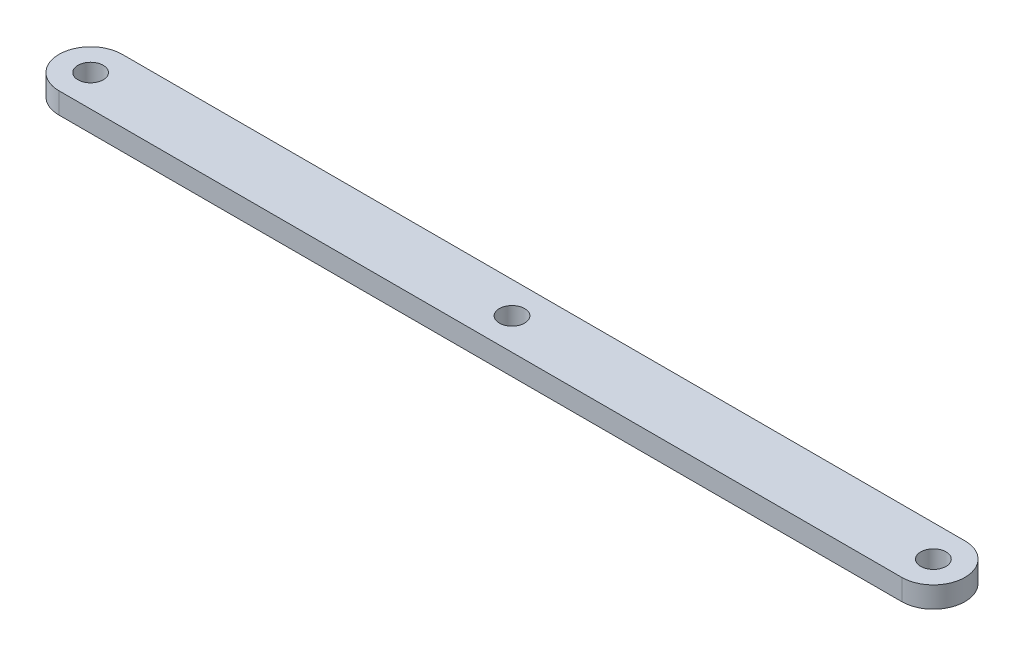
ISO-10303-21;
HEADER;
FILE_DESCRIPTION(('STEP AP214'),'2;1');
FILE_NAME('part.step','',(''),(''),'','','');
FILE_SCHEMA(('AUTOMOTIVE_DESIGN { 1 0 10303 214 1 1 1 1 }'));
ENDSEC;
DATA;
#1=APPLICATION_CONTEXT('core data for automotive mechanical design processes');
#2=APPLICATION_PROTOCOL_DEFINITION('international standard','automotive_design',2000,#1);
#3=PRODUCT_CONTEXT('',#1,'mechanical');
#4=PRODUCT('Part','Part','',(#3));
#5=PRODUCT_RELATED_PRODUCT_CATEGORY('part','',(#4));
#6=PRODUCT_DEFINITION_FORMATION('','',#4);
#7=PRODUCT_DEFINITION_CONTEXT('part definition',#1,'design');
#8=PRODUCT_DEFINITION('design','',#6,#7);
#9=PRODUCT_DEFINITION_SHAPE('','',#8);
#10=(LENGTH_UNIT() NAMED_UNIT(*) SI_UNIT(.MILLI.,.METRE.));
#11=(NAMED_UNIT(*) PLANE_ANGLE_UNIT() SI_UNIT($,.RADIAN.));
#12=(NAMED_UNIT(*) SI_UNIT($,.STERADIAN.) SOLID_ANGLE_UNIT());
#13=UNCERTAINTY_MEASURE_WITH_UNIT(LENGTH_MEASURE(1.E-05),#10,'distance_accuracy_value','');
#14=(GEOMETRIC_REPRESENTATION_CONTEXT(3) GLOBAL_UNCERTAINTY_ASSIGNED_CONTEXT((#13)) GLOBAL_UNIT_ASSIGNED_CONTEXT((#10,
#11,#12)) REPRESENTATION_CONTEXT('',''));
#15=CARTESIAN_POINT('',(0.,0.,0.));
#16=DIRECTION('',(0.,0.,1.));
#17=DIRECTION('',(1.,0.,0.));
#18=AXIS2_PLACEMENT_3D('',#15,#16,#17);
#19=CARTESIAN_POINT('',(0.,5.,0.));
#20=DIRECTION('',(0.,1.,0.));
#21=DIRECTION('',(0.,0.,1.));
#22=AXIS2_PLACEMENT_3D('',#19,#20,#21);
#23=PLANE('',#22);
#24=CARTESIAN_POINT('',(200.,5.,0.));
#25=DIRECTION('',(0.,1.,0.));
#26=DIRECTION('',(0.,0.,1.));
#27=AXIS2_PLACEMENT_3D('',#24,#25,#26);
#28=CIRCLE('',#27,2.99999999999999);
#29=CARTESIAN_POINT('',(200.,5.,2.99999999999999));
#30=VERTEX_POINT('',#29);
#31=EDGE_CURVE('E121',#30,#30,#28,.T.);
#32=ORIENTED_EDGE('',*,*,#31,.F.);
#33=EDGE_LOOP('',(#32));
#34=FACE_BOUND('',#33,.T.);
#35=CARTESIAN_POINT('',(0.,5.,0.));
#36=DIRECTION('',(0.,1.,0.));
#37=DIRECTION('',(0.,0.,1.));
#38=AXIS2_PLACEMENT_3D('',#35,#36,#37);
#39=CIRCLE('',#38,7.5);
#40=CARTESIAN_POINT('',(0.,5.,-7.5));
#41=VERTEX_POINT('',#40);
#42=CARTESIAN_POINT('',(0.,5.,7.5));
#43=VERTEX_POINT('',#42);
#44=EDGE_CURVE('E91',#41,#43,#39,.T.);
#45=ORIENTED_EDGE('',*,*,#44,.T.);
#46=DIRECTION('',(1.,0.,0.));
#47=VECTOR('',#46,1.);
#48=CARTESIAN_POINT('',(0.,5.,7.5));
#49=LINE('',#48,#47);
#50=CARTESIAN_POINT('',(200.,5.,7.50000000000001));
#51=VERTEX_POINT('',#50);
#52=EDGE_CURVE('E86',#43,#51,#49,.T.);
#53=ORIENTED_EDGE('',*,*,#52,.T.);
#54=CARTESIAN_POINT('',(200.,5.,0.));
#55=DIRECTION('',(0.,1.,0.));
#56=DIRECTION('',(0.,0.,1.));
#57=AXIS2_PLACEMENT_3D('',#54,#55,#56);
#58=CIRCLE('',#57,7.50000000000001);
#59=CARTESIAN_POINT('',(200.,5.,-7.50000000000001));
#60=VERTEX_POINT('',#59);
#61=EDGE_CURVE('E89',#51,#60,#58,.T.);
#62=ORIENTED_EDGE('',*,*,#61,.T.);
#63=DIRECTION('',(-1.,0.,0.));
#64=VECTOR('',#63,1.);
#65=CARTESIAN_POINT('',(0.,5.,-7.5));
#66=LINE('',#65,#64);
#67=EDGE_CURVE('E56',#60,#41,#66,.T.);
#68=ORIENTED_EDGE('',*,*,#67,.T.);
#69=EDGE_LOOP('',(#45,#53,#62,#68));
#70=FACE_BOUND('',#69,.T.);
#71=CARTESIAN_POINT('',(100.,5.,0.));
#72=DIRECTION('',(0.,1.,0.));
#73=DIRECTION('',(0.,0.,1.));
#74=AXIS2_PLACEMENT_3D('',#71,#72,#73);
#75=CIRCLE('',#74,3.00000000000001);
#76=CARTESIAN_POINT('',(100.,5.,3.00000000000001));
#77=VERTEX_POINT('',#76);
#78=EDGE_CURVE('E106',#77,#77,#75,.T.);
#79=ORIENTED_EDGE('',*,*,#78,.F.);
#80=EDGE_LOOP('',(#79));
#81=FACE_BOUND('',#80,.T.);
#82=CARTESIAN_POINT('',(0.,5.,0.));
#83=DIRECTION('',(0.,1.,0.));
#84=DIRECTION('',(0.,0.,1.));
#85=AXIS2_PLACEMENT_3D('',#82,#83,#84);
#86=CIRCLE('',#85,3.);
#87=CARTESIAN_POINT('',(0.,5.,3.));
#88=VERTEX_POINT('',#87);
#89=EDGE_CURVE('E127',#88,#88,#86,.T.);
#90=ORIENTED_EDGE('',*,*,#89,.F.);
#91=EDGE_LOOP('',(#90));
#92=FACE_BOUND('',#91,.T.);
#93=ADVANCED_FACE('F39',(#34,#70,#81,#92),#23,.T.);
#94=CARTESIAN_POINT('',(0.,0.,0.));
#95=DIRECTION('',(0.,1.,0.));
#96=DIRECTION('',(0.,0.,1.));
#97=AXIS2_PLACEMENT_3D('',#94,#95,#96);
#98=PLANE('',#97);
#99=CARTESIAN_POINT('',(0.,0.,0.));
#100=DIRECTION('',(0.,1.,0.));
#101=DIRECTION('',(0.,0.,1.));
#102=AXIS2_PLACEMENT_3D('',#99,#100,#101);
#103=CIRCLE('',#102,7.5);
#104=CARTESIAN_POINT('',(0.,0.,-7.5));
#105=VERTEX_POINT('',#104);
#106=CARTESIAN_POINT('',(0.,0.,7.5));
#107=VERTEX_POINT('',#106);
#108=EDGE_CURVE('E103',#105,#107,#103,.T.);
#109=ORIENTED_EDGE('',*,*,#108,.F.);
#110=DIRECTION('',(-1.,0.,0.));
#111=VECTOR('',#110,1.);
#112=CARTESIAN_POINT('',(0.,0.,-7.5));
#113=LINE('',#112,#111);
#114=CARTESIAN_POINT('',(200.,0.,-7.50000000000001));
#115=VERTEX_POINT('',#114);
#116=EDGE_CURVE('E79',#115,#105,#113,.T.);
#117=ORIENTED_EDGE('',*,*,#116,.F.);
#118=CARTESIAN_POINT('',(200.,0.,0.));
#119=DIRECTION('',(0.,1.,0.));
#120=DIRECTION('',(0.,0.,1.));
#121=AXIS2_PLACEMENT_3D('',#118,#119,#120);
#122=CIRCLE('',#121,7.50000000000001);
#123=CARTESIAN_POINT('',(200.,0.,7.50000000000001));
#124=VERTEX_POINT('',#123);
#125=EDGE_CURVE('E73',#124,#115,#122,.T.);
#126=ORIENTED_EDGE('',*,*,#125,.F.);
#127=DIRECTION('',(1.,0.,0.));
#128=VECTOR('',#127,1.);
#129=CARTESIAN_POINT('',(0.,0.,7.5));
#130=LINE('',#129,#128);
#131=EDGE_CURVE('E95',#107,#124,#130,.T.);
#132=ORIENTED_EDGE('',*,*,#131,.F.);
#133=EDGE_LOOP('',(#109,#117,#126,#132));
#134=FACE_BOUND('',#133,.T.);
#135=CARTESIAN_POINT('',(100.,0.,0.));
#136=DIRECTION('',(0.,1.,0.));
#137=DIRECTION('',(0.,0.,1.));
#138=AXIS2_PLACEMENT_3D('',#135,#136,#137);
#139=CIRCLE('',#138,3.00000000000001);
#140=CARTESIAN_POINT('',(100.,0.,3.00000000000001));
#141=VERTEX_POINT('',#140);
#142=EDGE_CURVE('E118',#141,#141,#139,.T.);
#143=ORIENTED_EDGE('',*,*,#142,.T.);
#144=EDGE_LOOP('',(#143));
#145=FACE_BOUND('',#144,.T.);
#146=CARTESIAN_POINT('',(200.,0.,0.));
#147=DIRECTION('',(0.,1.,0.));
#148=DIRECTION('',(0.,0.,1.));
#149=AXIS2_PLACEMENT_3D('',#146,#147,#148);
#150=CIRCLE('',#149,2.99999999999999);
#151=CARTESIAN_POINT('',(200.,0.,2.99999999999999));
#152=VERTEX_POINT('',#151);
#153=EDGE_CURVE('E124',#152,#152,#150,.T.);
#154=ORIENTED_EDGE('',*,*,#153,.T.);
#155=EDGE_LOOP('',(#154));
#156=FACE_BOUND('',#155,.T.);
#157=CARTESIAN_POINT('',(0.,0.,0.));
#158=DIRECTION('',(0.,1.,0.));
#159=DIRECTION('',(0.,0.,1.));
#160=AXIS2_PLACEMENT_3D('',#157,#158,#159);
#161=CIRCLE('',#160,3.);
#162=CARTESIAN_POINT('',(0.,0.,3.));
#163=VERTEX_POINT('',#162);
#164=EDGE_CURVE('E130',#163,#163,#161,.T.);
#165=ORIENTED_EDGE('',*,*,#164,.T.);
#166=EDGE_LOOP('',(#165));
#167=FACE_BOUND('',#166,.T.);
#168=ADVANCED_FACE('F114',(#134,#145,#156,#167),#98,.F.);
#169=CARTESIAN_POINT('',(0.,5.,0.));
#170=DIRECTION('',(0.,-1.,0.));
#171=DIRECTION('',(0.,0.,-1.));
#172=AXIS2_PLACEMENT_3D('',#169,#170,#171);
#173=CYLINDRICAL_SURFACE('',#172,7.5);
#174=ORIENTED_EDGE('',*,*,#108,.T.);
#175=DIRECTION('',(0.,-1.,0.));
#176=VECTOR('',#175,1.);
#177=CARTESIAN_POINT('',(0.,5.,7.5));
#178=LINE('',#177,#176);
#179=EDGE_CURVE('E11',#43,#107,#178,.T.);
#180=ORIENTED_EDGE('',*,*,#179,.F.);
#181=ORIENTED_EDGE('',*,*,#44,.F.);
#182=DIRECTION('',(0.,-1.,0.));
#183=VECTOR('',#182,1.);
#184=CARTESIAN_POINT('',(0.,5.,-7.5));
#185=LINE('',#184,#183);
#186=EDGE_CURVE('E99',#41,#105,#185,.T.);
#187=ORIENTED_EDGE('',*,*,#186,.T.);
#188=EDGE_LOOP('',(#174,#180,#181,#187));
#189=FACE_BOUND('',#188,.T.);
#190=ADVANCED_FACE('F41',(#189),#173,.T.);
#191=CARTESIAN_POINT('',(0.,5.,7.5));
#192=DIRECTION('',(0.,0.,-1.));
#193=DIRECTION('',(-1.,0.,0.));
#194=AXIS2_PLACEMENT_3D('',#191,#192,#193);
#195=PLANE('',#194);
#196=ORIENTED_EDGE('',*,*,#131,.T.);
#197=DIRECTION('',(0.,-1.,0.));
#198=VECTOR('',#197,1.);
#199=CARTESIAN_POINT('',(200.,5.,7.50000000000001));
#200=LINE('',#199,#198);
#201=EDGE_CURVE('E48',#51,#124,#200,.T.);
#202=ORIENTED_EDGE('',*,*,#201,.F.);
#203=ORIENTED_EDGE('',*,*,#52,.F.);
#204=ORIENTED_EDGE('',*,*,#179,.T.);
#205=EDGE_LOOP('',(#196,#202,#203,#204));
#206=FACE_BOUND('',#205,.T.);
#207=ADVANCED_FACE('F94',(#206),#195,.F.);
#208=CARTESIAN_POINT('',(200.,5.,0.));
#209=DIRECTION('',(0.,-1.,0.));
#210=DIRECTION('',(0.,0.,-1.));
#211=AXIS2_PLACEMENT_3D('',#208,#209,#210);
#212=CYLINDRICAL_SURFACE('',#211,7.50000000000001);
#213=ORIENTED_EDGE('',*,*,#125,.T.);
#214=DIRECTION('',(0.,-1.,0.));
#215=VECTOR('',#214,1.);
#216=CARTESIAN_POINT('',(200.,5.,-7.50000000000001));
#217=LINE('',#216,#215);
#218=EDGE_CURVE('E96',#60,#115,#217,.T.);
#219=ORIENTED_EDGE('',*,*,#218,.F.);
#220=ORIENTED_EDGE('',*,*,#61,.F.);
#221=ORIENTED_EDGE('',*,*,#201,.T.);
#222=EDGE_LOOP('',(#213,#219,#220,#221));
#223=FACE_BOUND('',#222,.T.);
#224=ADVANCED_FACE('F97',(#223),#212,.T.);
#225=CARTESIAN_POINT('',(0.,5.,-7.5));
#226=DIRECTION('',(0.,0.,1.));
#227=DIRECTION('',(1.,0.,0.));
#228=AXIS2_PLACEMENT_3D('',#225,#226,#227);
#229=PLANE('',#228);
#230=ORIENTED_EDGE('',*,*,#116,.T.);
#231=ORIENTED_EDGE('',*,*,#186,.F.);
#232=ORIENTED_EDGE('',*,*,#67,.F.);
#233=ORIENTED_EDGE('',*,*,#218,.T.);
#234=EDGE_LOOP('',(#230,#231,#232,#233));
#235=FACE_BOUND('',#234,.T.);
#236=ADVANCED_FACE('F111',(#235),#229,.F.);
#237=CARTESIAN_POINT('',(100.,5.,0.));
#238=DIRECTION('',(0.,-1.,0.));
#239=DIRECTION('',(0.,0.,-1.));
#240=AXIS2_PLACEMENT_3D('',#237,#238,#239);
#241=CYLINDRICAL_SURFACE('',#240,3.00000000000001);
#242=ORIENTED_EDGE('',*,*,#78,.T.);
#243=EDGE_LOOP('',(#242));
#244=FACE_BOUND('',#243,.T.);
#245=ORIENTED_EDGE('',*,*,#142,.F.);
#246=EDGE_LOOP('',(#245));
#247=FACE_BOUND('',#246,.T.);
#248=ADVANCED_FACE('F148',(#244,#247),#241,.F.);
#249=CARTESIAN_POINT('',(200.,5.,0.));
#250=DIRECTION('',(0.,-1.,0.));
#251=DIRECTION('',(0.,0.,-1.));
#252=AXIS2_PLACEMENT_3D('',#249,#250,#251);
#253=CYLINDRICAL_SURFACE('',#252,2.99999999999999);
#254=ORIENTED_EDGE('',*,*,#31,.T.);
#255=EDGE_LOOP('',(#254));
#256=FACE_BOUND('',#255,.T.);
#257=ORIENTED_EDGE('',*,*,#153,.F.);
#258=EDGE_LOOP('',(#257));
#259=FACE_BOUND('',#258,.T.);
#260=ADVANCED_FACE('F202',(#256,#259),#253,.F.);
#261=CARTESIAN_POINT('',(0.,5.,0.));
#262=DIRECTION('',(0.,-1.,0.));
#263=DIRECTION('',(0.,0.,-1.));
#264=AXIS2_PLACEMENT_3D('',#261,#262,#263);
#265=CYLINDRICAL_SURFACE('',#264,3.);
#266=ORIENTED_EDGE('',*,*,#89,.T.);
#267=EDGE_LOOP('',(#266));
#268=FACE_BOUND('',#267,.T.);
#269=ORIENTED_EDGE('',*,*,#164,.F.);
#270=EDGE_LOOP('',(#269));
#271=FACE_BOUND('',#270,.T.);
#272=ADVANCED_FACE('F136',(#268,#271),#265,.F.);
#273=CLOSED_SHELL('',(#93,#168,#190,#207,#224,#236,#248,#260,#272));
#274=MANIFOLD_SOLID_BREP('B2',#273);
#275=ADVANCED_BREP_SHAPE_REPRESENTATION('',(#18,#274),#14);
#276=SHAPE_DEFINITION_REPRESENTATION(#9,#275);
ENDSEC;
END-ISO-10303-21;
